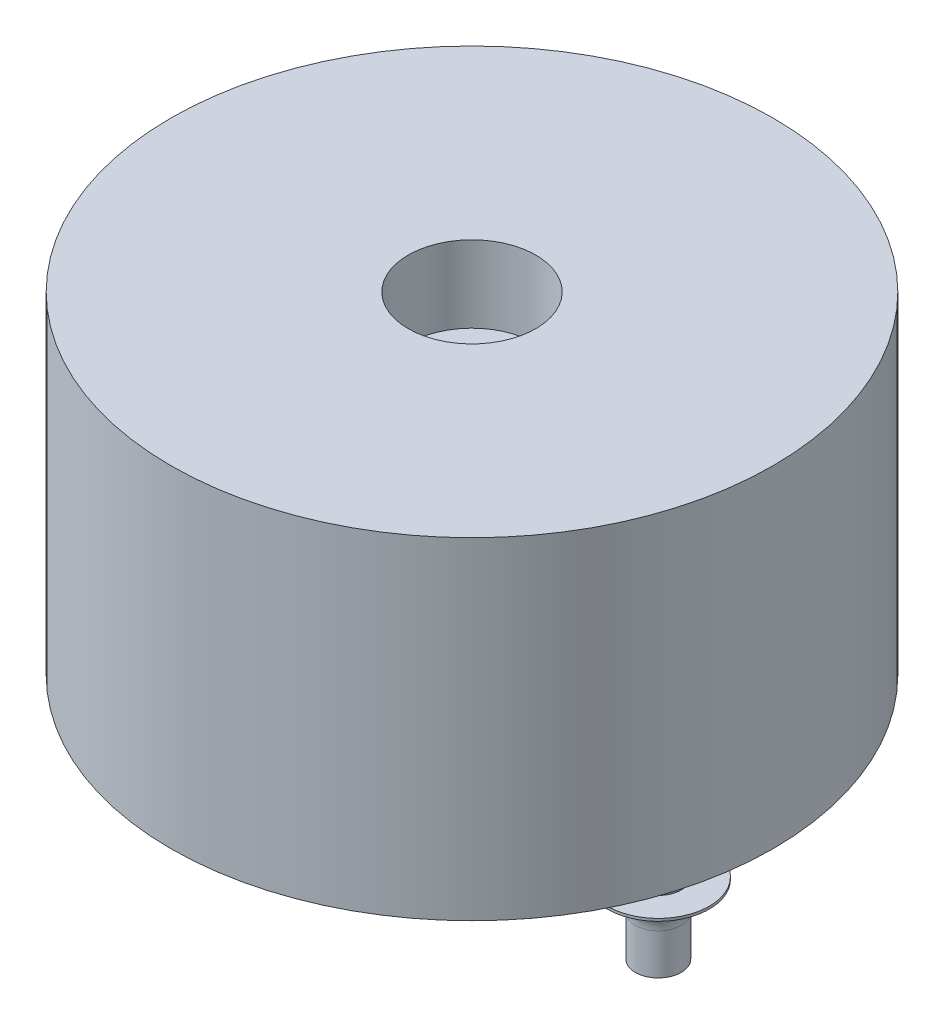
ISO-10303-21;
HEADER;
FILE_DESCRIPTION(('STEP AP214'),'2;1');
FILE_NAME('part.step','',(''),(''),'','','');
FILE_SCHEMA(('AUTOMOTIVE_DESIGN { 1 0 10303 214 1 1 1 1 }'));
ENDSEC;
DATA;
#1=APPLICATION_CONTEXT('core data for automotive mechanical design processes');
#2=APPLICATION_PROTOCOL_DEFINITION('international standard','automotive_design',2000,#1);
#3=PRODUCT_CONTEXT('',#1,'mechanical');
#4=PRODUCT('Part','Part','',(#3));
#5=PRODUCT_RELATED_PRODUCT_CATEGORY('part','',(#4));
#6=PRODUCT_DEFINITION_FORMATION('','',#4);
#7=PRODUCT_DEFINITION_CONTEXT('part definition',#1,'design');
#8=PRODUCT_DEFINITION('design','',#6,#7);
#9=PRODUCT_DEFINITION_SHAPE('','',#8);
#10=(LENGTH_UNIT() NAMED_UNIT(*) SI_UNIT(.MILLI.,.METRE.));
#11=(NAMED_UNIT(*) PLANE_ANGLE_UNIT() SI_UNIT($,.RADIAN.));
#12=(NAMED_UNIT(*) SI_UNIT($,.STERADIAN.) SOLID_ANGLE_UNIT());
#13=UNCERTAINTY_MEASURE_WITH_UNIT(LENGTH_MEASURE(1.E-05),#10,'distance_accuracy_value','');
#14=(GEOMETRIC_REPRESENTATION_CONTEXT(3) GLOBAL_UNCERTAINTY_ASSIGNED_CONTEXT((#13)) GLOBAL_UNIT_ASSIGNED_CONTEXT((#10,
#11,#12)) REPRESENTATION_CONTEXT('',''));
#15=CARTESIAN_POINT('',(0.,0.,0.));
#16=DIRECTION('',(0.,0.,1.));
#17=DIRECTION('',(1.,0.,0.));
#18=AXIS2_PLACEMENT_3D('',#15,#16,#17);
#19=CARTESIAN_POINT('',(0.,6.5,0.));
#20=DIRECTION('',(0.,-1.,0.));
#21=DIRECTION('',(0.,0.,-1.));
#22=AXIS2_PLACEMENT_3D('',#19,#20,#21);
#23=CYLINDRICAL_SURFACE('',#22,5.9);
#24=CARTESIAN_POINT('',(0.,6.5,0.));
#25=DIRECTION('',(0.,1.,0.));
#26=DIRECTION('',(0.,0.,1.));
#27=AXIS2_PLACEMENT_3D('',#24,#25,#26);
#28=CIRCLE('',#27,5.9);
#29=CARTESIAN_POINT('',(0.,6.5,5.9));
#30=VERTEX_POINT('',#29);
#31=EDGE_CURVE('E10',#30,#30,#28,.T.);
#32=ORIENTED_EDGE('',*,*,#31,.F.);
#33=EDGE_LOOP('',(#32));
#34=FACE_BOUND('',#33,.T.);
#35=CARTESIAN_POINT('',(0.,0.,0.));
#36=DIRECTION('',(0.,1.,0.));
#37=DIRECTION('',(0.,0.,1.));
#38=AXIS2_PLACEMENT_3D('',#35,#36,#37);
#39=CIRCLE('',#38,5.9);
#40=CARTESIAN_POINT('',(0.,0.,5.9));
#41=VERTEX_POINT('',#40);
#42=EDGE_CURVE('E36',#41,#41,#39,.T.);
#43=ORIENTED_EDGE('',*,*,#42,.T.);
#44=EDGE_LOOP('',(#43));
#45=FACE_BOUND('',#44,.T.);
#46=ADVANCED_FACE('F33',(#34,#45),#23,.T.);
#47=CARTESIAN_POINT('',(0.,6.5,0.));
#48=DIRECTION('',(0.,1.,0.));
#49=DIRECTION('',(0.,0.,1.));
#50=AXIS2_PLACEMENT_3D('',#47,#48,#49);
#51=PLANE('',#50);
#52=CARTESIAN_POINT('',(0.,6.5,0.));
#53=DIRECTION('',(0.,1.,0.));
#54=DIRECTION('',(0.,0.,1.));
#55=AXIS2_PLACEMENT_3D('',#52,#53,#54);
#56=CIRCLE('',#55,1.25);
#57=CARTESIAN_POINT('',(0.,6.5,1.25));
#58=VERTEX_POINT('',#57);
#59=EDGE_CURVE('E45',#58,#58,#56,.T.);
#60=ORIENTED_EDGE('',*,*,#59,.F.);
#61=EDGE_LOOP('',(#60));
#62=FACE_BOUND('',#61,.T.);
#63=ORIENTED_EDGE('',*,*,#31,.T.);
#64=EDGE_LOOP('',(#63));
#65=FACE_BOUND('',#64,.T.);
#66=ADVANCED_FACE('F99',(#62,#65),#51,.T.);
#67=CARTESIAN_POINT('',(0.,0.,0.));
#68=DIRECTION('',(0.,1.,0.));
#69=DIRECTION('',(0.,0.,1.));
#70=AXIS2_PLACEMENT_3D('',#67,#68,#69);
#71=PLANE('',#70);
#72=CARTESIAN_POINT('',(3.65,0.,0.));
#73=DIRECTION('',(0.,1.,0.));
#74=DIRECTION('',(-1.,0.,0.));
#75=AXIS2_PLACEMENT_3D('',#72,#73,#74);
#76=CIRCLE('',#75,0.449999999999999);
#77=CARTESIAN_POINT('',(3.2,0.,0.));
#78=VERTEX_POINT('',#77);
#79=EDGE_CURVE('E68',#78,#78,#76,.T.);
#80=ORIENTED_EDGE('',*,*,#79,.T.);
#81=EDGE_LOOP('',(#80));
#82=FACE_BOUND('',#81,.T.);
#83=CARTESIAN_POINT('',(-3.65,0.,0.));
#84=DIRECTION('',(0.,1.,0.));
#85=DIRECTION('',(-1.,0.,0.));
#86=AXIS2_PLACEMENT_3D('',#83,#84,#85);
#87=CIRCLE('',#86,0.449999999999999);
#88=CARTESIAN_POINT('',(-4.1,0.,0.));
#89=VERTEX_POINT('',#88);
#90=EDGE_CURVE('E48',#89,#89,#87,.T.);
#91=ORIENTED_EDGE('',*,*,#90,.T.);
#92=EDGE_LOOP('',(#91));
#93=FACE_BOUND('',#92,.T.);
#94=ORIENTED_EDGE('',*,*,#42,.F.);
#95=EDGE_LOOP('',(#94));
#96=FACE_BOUND('',#95,.T.);
#97=ADVANCED_FACE('F104',(#82,#93,#96),#71,.F.);
#98=CARTESIAN_POINT('',(0.,5.,0.));
#99=DIRECTION('',(0.,1.,0.));
#100=DIRECTION('',(0.,0.,1.));
#101=AXIS2_PLACEMENT_3D('',#98,#99,#100);
#102=CYLINDRICAL_SURFACE('',#101,1.25);
#103=CARTESIAN_POINT('',(0.,5.,0.));
#104=DIRECTION('',(0.,1.,0.));
#105=DIRECTION('',(0.,0.,1.));
#106=AXIS2_PLACEMENT_3D('',#103,#104,#105);
#107=CIRCLE('',#106,1.25);
#108=CARTESIAN_POINT('',(0.,5.,1.25));
#109=VERTEX_POINT('',#108);
#110=EDGE_CURVE('E43',#109,#109,#107,.T.);
#111=ORIENTED_EDGE('',*,*,#110,.F.);
#112=EDGE_LOOP('',(#111));
#113=FACE_BOUND('',#112,.T.);
#114=ORIENTED_EDGE('',*,*,#59,.T.);
#115=EDGE_LOOP('',(#114));
#116=FACE_BOUND('',#115,.T.);
#117=ADVANCED_FACE('F111',(#113,#116),#102,.F.);
#118=CARTESIAN_POINT('',(0.,5.,0.));
#119=DIRECTION('',(0.,1.,0.));
#120=DIRECTION('',(0.,0.,1.));
#121=AXIS2_PLACEMENT_3D('',#118,#119,#120);
#122=PLANE('',#121);
#123=ORIENTED_EDGE('',*,*,#110,.T.);
#124=EDGE_LOOP('',(#123));
#125=FACE_BOUND('',#124,.T.);
#126=ADVANCED_FACE('F116',(#125),#122,.T.);
#127=CARTESIAN_POINT('',(-3.65,0.,0.));
#128=DIRECTION('',(0.,1.,0.));
#129=DIRECTION('',(-1.,0.,0.));
#130=AXIS2_PLACEMENT_3D('',#127,#128,#129);
#131=CYLINDRICAL_SURFACE('',#130,0.45);
#132=CARTESIAN_POINT('',(-3.65,-1.6,0.));
#133=DIRECTION('',(0.,1.,0.));
#134=DIRECTION('',(-1.,0.,0.));
#135=AXIS2_PLACEMENT_3D('',#132,#133,#134);
#136=CIRCLE('',#135,0.45);
#137=CARTESIAN_POINT('',(-4.1,-1.6,0.));
#138=VERTEX_POINT('',#137);
#139=EDGE_CURVE('E53',#138,#138,#136,.T.);
#140=ORIENTED_EDGE('',*,*,#139,.T.);
#141=EDGE_LOOP('',(#140));
#142=FACE_BOUND('',#141,.T.);
#143=ORIENTED_EDGE('',*,*,#90,.F.);
#144=EDGE_LOOP('',(#143));
#145=FACE_BOUND('',#144,.T.);
#146=ADVANCED_FACE('F123',(#142,#145),#131,.T.);
#147=CARTESIAN_POINT('',(-4.1,-1.6,0.));
#148=DIRECTION('',(0.,1.,0.));
#149=DIRECTION('',(-1.,0.,0.));
#150=AXIS2_PLACEMENT_3D('',#147,#148,#149);
#151=PLANE('',#150);
#152=CARTESIAN_POINT('',(-3.65,-1.6,0.));
#153=DIRECTION('',(0.,1.,0.));
#154=DIRECTION('',(-1.,0.,0.));
#155=AXIS2_PLACEMENT_3D('',#152,#153,#154);
#156=CIRCLE('',#155,1.);
#157=CARTESIAN_POINT('',(-4.65,-1.6,0.));
#158=VERTEX_POINT('',#157);
#159=EDGE_CURVE('E56',#158,#158,#156,.T.);
#160=ORIENTED_EDGE('',*,*,#159,.T.);
#161=EDGE_LOOP('',(#160));
#162=FACE_BOUND('',#161,.T.);
#163=ORIENTED_EDGE('',*,*,#139,.F.);
#164=EDGE_LOOP('',(#163));
#165=FACE_BOUND('',#164,.T.);
#166=ADVANCED_FACE('F127',(#162,#165),#151,.T.);
#167=CARTESIAN_POINT('',(-3.65,0.,0.));
#168=DIRECTION('',(0.,1.,0.));
#169=DIRECTION('',(-1.,0.,0.));
#170=AXIS2_PLACEMENT_3D('',#167,#168,#169);
#171=CYLINDRICAL_SURFACE('',#170,1.);
#172=CARTESIAN_POINT('',(-3.65,-1.65,0.));
#173=DIRECTION('',(0.,1.,0.));
#174=DIRECTION('',(-1.,0.,0.));
#175=AXIS2_PLACEMENT_3D('',#172,#173,#174);
#176=CIRCLE('',#175,1.);
#177=CARTESIAN_POINT('',(-4.65,-1.65,0.));
#178=VERTEX_POINT('',#177);
#179=EDGE_CURVE('E59',#178,#178,#176,.T.);
#180=ORIENTED_EDGE('',*,*,#179,.T.);
#181=EDGE_LOOP('',(#180));
#182=FACE_BOUND('',#181,.T.);
#183=ORIENTED_EDGE('',*,*,#159,.F.);
#184=EDGE_LOOP('',(#183));
#185=FACE_BOUND('',#184,.T.);
#186=ADVANCED_FACE('F131',(#182,#185),#171,.T.);
#187=CARTESIAN_POINT('',(-3.65,-2.2,0.));
#188=DIRECTION('',(0.,1.,0.));
#189=DIRECTION('',(-1.,0.,0.));
#190=AXIS2_PLACEMENT_3D('',#187,#188,#189);
#191=TOROIDAL_SURFACE('',#190,1.,0.550000000000001);
#192=CARTESIAN_POINT('',(-3.65,-2.2,0.));
#193=DIRECTION('',(0.,1.,0.));
#194=DIRECTION('',(-1.,0.,0.));
#195=AXIS2_PLACEMENT_3D('',#192,#193,#194);
#196=CIRCLE('',#195,0.45);
#197=CARTESIAN_POINT('',(-4.1,-2.2,0.));
#198=VERTEX_POINT('',#197);
#199=EDGE_CURVE('E62',#198,#198,#196,.T.);
#200=ORIENTED_EDGE('',*,*,#199,.T.);
#201=EDGE_LOOP('',(#200));
#202=FACE_BOUND('',#201,.T.);
#203=ORIENTED_EDGE('',*,*,#179,.F.);
#204=EDGE_LOOP('',(#203));
#205=FACE_BOUND('',#204,.T.);
#206=ADVANCED_FACE('F135',(#202,#205),#191,.F.);
#207=CARTESIAN_POINT('',(-3.65,0.,0.));
#208=DIRECTION('',(0.,1.,0.));
#209=DIRECTION('',(-1.,0.,0.));
#210=AXIS2_PLACEMENT_3D('',#207,#208,#209);
#211=CYLINDRICAL_SURFACE('',#210,0.45);
#212=CARTESIAN_POINT('',(-3.65,-3.,0.));
#213=DIRECTION('',(0.,1.,0.));
#214=DIRECTION('',(-1.,0.,0.));
#215=AXIS2_PLACEMENT_3D('',#212,#213,#214);
#216=CIRCLE('',#215,0.45);
#217=CARTESIAN_POINT('',(-4.1,-3.,0.));
#218=VERTEX_POINT('',#217);
#219=EDGE_CURVE('E65',#218,#218,#216,.T.);
#220=ORIENTED_EDGE('',*,*,#219,.T.);
#221=EDGE_LOOP('',(#220));
#222=FACE_BOUND('',#221,.T.);
#223=ORIENTED_EDGE('',*,*,#199,.F.);
#224=EDGE_LOOP('',(#223));
#225=FACE_BOUND('',#224,.T.);
#226=ADVANCED_FACE('F139',(#222,#225),#211,.T.);
#227=CARTESIAN_POINT('',(-3.65,-3.,0.));
#228=DIRECTION('',(0.,-1.,0.));
#229=DIRECTION('',(1.,0.,0.));
#230=AXIS2_PLACEMENT_3D('',#227,#228,#229);
#231=PLANE('',#230);
#232=ORIENTED_EDGE('',*,*,#219,.F.);
#233=EDGE_LOOP('',(#232));
#234=FACE_BOUND('',#233,.T.);
#235=ADVANCED_FACE('F143',(#234),#231,.T.);
#236=CARTESIAN_POINT('',(3.65,0.,0.));
#237=DIRECTION('',(0.,1.,0.));
#238=DIRECTION('',(-1.,0.,0.));
#239=AXIS2_PLACEMENT_3D('',#236,#237,#238);
#240=CYLINDRICAL_SURFACE('',#239,0.45);
#241=CARTESIAN_POINT('',(3.65,-1.6,0.));
#242=DIRECTION('',(0.,1.,0.));
#243=DIRECTION('',(-1.,0.,0.));
#244=AXIS2_PLACEMENT_3D('',#241,#242,#243);
#245=CIRCLE('',#244,0.45);
#246=CARTESIAN_POINT('',(3.2,-1.6,0.));
#247=VERTEX_POINT('',#246);
#248=EDGE_CURVE('E71',#247,#247,#245,.T.);
#249=ORIENTED_EDGE('',*,*,#248,.T.);
#250=EDGE_LOOP('',(#249));
#251=FACE_BOUND('',#250,.T.);
#252=ORIENTED_EDGE('',*,*,#79,.F.);
#253=EDGE_LOOP('',(#252));
#254=FACE_BOUND('',#253,.T.);
#255=ADVANCED_FACE('F147',(#251,#254),#240,.T.);
#256=CARTESIAN_POINT('',(3.2,-1.6,0.));
#257=DIRECTION('',(0.,1.,0.));
#258=DIRECTION('',(-1.,0.,0.));
#259=AXIS2_PLACEMENT_3D('',#256,#257,#258);
#260=PLANE('',#259);
#261=CARTESIAN_POINT('',(3.65,-1.6,0.));
#262=DIRECTION('',(0.,1.,0.));
#263=DIRECTION('',(-1.,0.,0.));
#264=AXIS2_PLACEMENT_3D('',#261,#262,#263);
#265=CIRCLE('',#264,1.);
#266=CARTESIAN_POINT('',(2.65,-1.6,0.));
#267=VERTEX_POINT('',#266);
#268=EDGE_CURVE('E74',#267,#267,#265,.T.);
#269=ORIENTED_EDGE('',*,*,#268,.T.);
#270=EDGE_LOOP('',(#269));
#271=FACE_BOUND('',#270,.T.);
#272=ORIENTED_EDGE('',*,*,#248,.F.);
#273=EDGE_LOOP('',(#272));
#274=FACE_BOUND('',#273,.T.);
#275=ADVANCED_FACE('F151',(#271,#274),#260,.T.);
#276=CARTESIAN_POINT('',(3.65,0.,0.));
#277=DIRECTION('',(0.,1.,0.));
#278=DIRECTION('',(-1.,0.,0.));
#279=AXIS2_PLACEMENT_3D('',#276,#277,#278);
#280=CYLINDRICAL_SURFACE('',#279,1.);
#281=CARTESIAN_POINT('',(3.65,-1.65,0.));
#282=DIRECTION('',(0.,1.,0.));
#283=DIRECTION('',(-1.,0.,0.));
#284=AXIS2_PLACEMENT_3D('',#281,#282,#283);
#285=CIRCLE('',#284,1.);
#286=CARTESIAN_POINT('',(2.65,-1.65,0.));
#287=VERTEX_POINT('',#286);
#288=EDGE_CURVE('E77',#287,#287,#285,.T.);
#289=ORIENTED_EDGE('',*,*,#288,.T.);
#290=EDGE_LOOP('',(#289));
#291=FACE_BOUND('',#290,.T.);
#292=ORIENTED_EDGE('',*,*,#268,.F.);
#293=EDGE_LOOP('',(#292));
#294=FACE_BOUND('',#293,.T.);
#295=ADVANCED_FACE('F155',(#291,#294),#280,.T.);
#296=CARTESIAN_POINT('',(3.65,-2.2,0.));
#297=DIRECTION('',(0.,1.,0.));
#298=DIRECTION('',(-1.,0.,0.));
#299=AXIS2_PLACEMENT_3D('',#296,#297,#298);
#300=TOROIDAL_SURFACE('',#299,1.,0.550000000000001);
#301=CARTESIAN_POINT('',(3.65,-2.2,0.));
#302=DIRECTION('',(0.,1.,0.));
#303=DIRECTION('',(-1.,0.,0.));
#304=AXIS2_PLACEMENT_3D('',#301,#302,#303);
#305=CIRCLE('',#304,0.45);
#306=CARTESIAN_POINT('',(3.2,-2.2,0.));
#307=VERTEX_POINT('',#306);
#308=EDGE_CURVE('E80',#307,#307,#305,.T.);
#309=ORIENTED_EDGE('',*,*,#308,.T.);
#310=EDGE_LOOP('',(#309));
#311=FACE_BOUND('',#310,.T.);
#312=ORIENTED_EDGE('',*,*,#288,.F.);
#313=EDGE_LOOP('',(#312));
#314=FACE_BOUND('',#313,.T.);
#315=ADVANCED_FACE('F96',(#311,#314),#300,.F.);
#316=CARTESIAN_POINT('',(3.65,0.,0.));
#317=DIRECTION('',(0.,1.,0.));
#318=DIRECTION('',(-1.,0.,0.));
#319=AXIS2_PLACEMENT_3D('',#316,#317,#318);
#320=CYLINDRICAL_SURFACE('',#319,0.45);
#321=CARTESIAN_POINT('',(3.65,-3.,0.));
#322=DIRECTION('',(0.,1.,0.));
#323=DIRECTION('',(-1.,0.,0.));
#324=AXIS2_PLACEMENT_3D('',#321,#322,#323);
#325=CIRCLE('',#324,0.45);
#326=CARTESIAN_POINT('',(3.2,-3.,0.));
#327=VERTEX_POINT('',#326);
#328=EDGE_CURVE('E83',#327,#327,#325,.T.);
#329=ORIENTED_EDGE('',*,*,#328,.T.);
#330=EDGE_LOOP('',(#329));
#331=FACE_BOUND('',#330,.T.);
#332=ORIENTED_EDGE('',*,*,#308,.F.);
#333=EDGE_LOOP('',(#332));
#334=FACE_BOUND('',#333,.T.);
#335=ADVANCED_FACE('F87',(#331,#334),#320,.T.);
#336=CARTESIAN_POINT('',(3.65,-3.,0.));
#337=DIRECTION('',(0.,-1.,0.));
#338=DIRECTION('',(1.,0.,0.));
#339=AXIS2_PLACEMENT_3D('',#336,#337,#338);
#340=PLANE('',#339);
#341=ORIENTED_EDGE('',*,*,#328,.F.);
#342=EDGE_LOOP('',(#341));
#343=FACE_BOUND('',#342,.T.);
#344=ADVANCED_FACE('F90',(#343),#340,.T.);
#345=CLOSED_SHELL('',(#46,#66,#97,#117,#126,#146,#166,#186,#206,#226,#235,#255,#275,#295,#315,
#335,#344));
#346=MANIFOLD_SOLID_BREP('B2',#345);
#347=ADVANCED_BREP_SHAPE_REPRESENTATION('',(#18,#346),#14);
#348=SHAPE_DEFINITION_REPRESENTATION(#9,#347);
ENDSEC;
END-ISO-10303-21;
